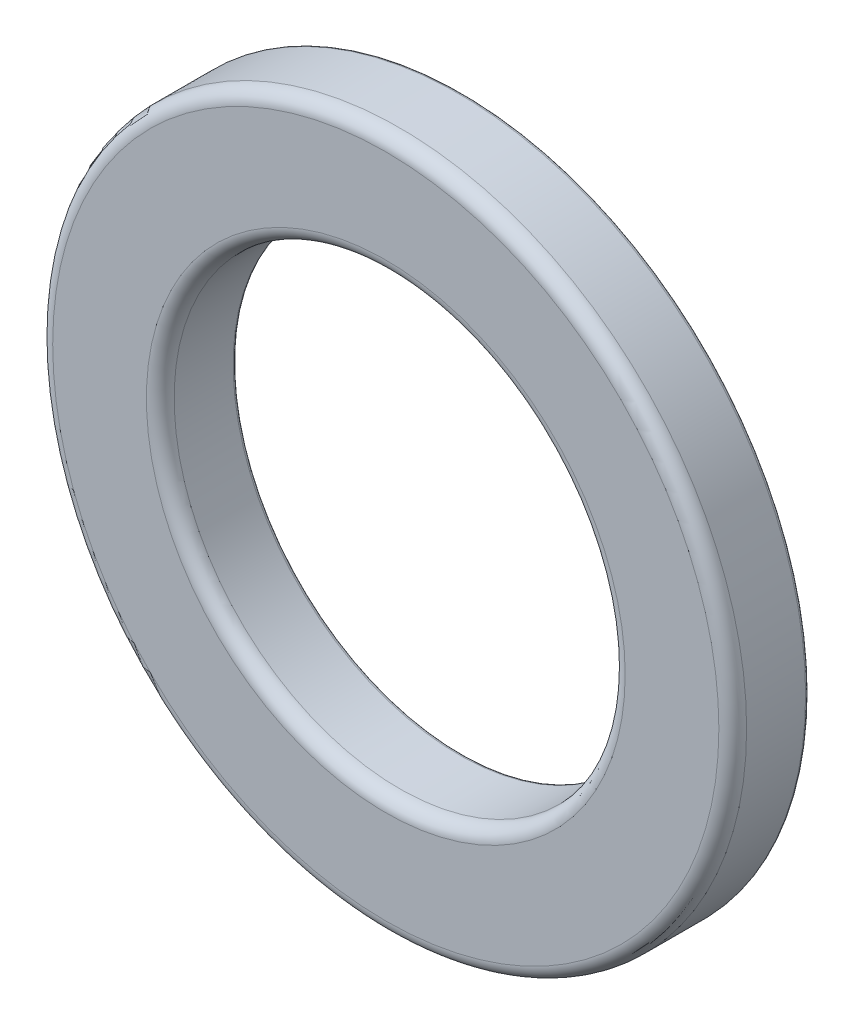
ISO-10303-21;
HEADER;
FILE_DESCRIPTION(('STEP AP214'),'2;1');
FILE_NAME('part.step','',(''),(''),'','','');
FILE_SCHEMA(('AUTOMOTIVE_DESIGN { 1 0 10303 214 1 1 1 1 }'));
ENDSEC;
DATA;
#1=APPLICATION_CONTEXT('core data for automotive mechanical design processes');
#2=APPLICATION_PROTOCOL_DEFINITION('international standard','automotive_design',2000,#1);
#3=PRODUCT_CONTEXT('',#1,'mechanical');
#4=PRODUCT('Part','Part','',(#3));
#5=PRODUCT_RELATED_PRODUCT_CATEGORY('part','',(#4));
#6=PRODUCT_DEFINITION_FORMATION('','',#4);
#7=PRODUCT_DEFINITION_CONTEXT('part definition',#1,'design');
#8=PRODUCT_DEFINITION('design','',#6,#7);
#9=PRODUCT_DEFINITION_SHAPE('','',#8);
#10=(LENGTH_UNIT() NAMED_UNIT(*) SI_UNIT(.MILLI.,.METRE.));
#11=(NAMED_UNIT(*) PLANE_ANGLE_UNIT() SI_UNIT($,.RADIAN.));
#12=(NAMED_UNIT(*) SI_UNIT($,.STERADIAN.) SOLID_ANGLE_UNIT());
#13=UNCERTAINTY_MEASURE_WITH_UNIT(LENGTH_MEASURE(1.E-05),#10,'distance_accuracy_value','');
#14=(GEOMETRIC_REPRESENTATION_CONTEXT(3) GLOBAL_UNCERTAINTY_ASSIGNED_CONTEXT((#13)) GLOBAL_UNIT_ASSIGNED_CONTEXT((#10,
#11,#12)) REPRESENTATION_CONTEXT('',''));
#15=CARTESIAN_POINT('',(0.,0.,0.));
#16=DIRECTION('',(0.,0.,1.));
#17=DIRECTION('',(1.,0.,0.));
#18=AXIS2_PLACEMENT_3D('',#15,#16,#17);
#19=CARTESIAN_POINT('',(0.,0.,-1.1));
#20=DIRECTION('',(0.,0.,1.));
#21=DIRECTION('',(1.,0.,0.));
#22=AXIS2_PLACEMENT_3D('',#19,#20,#21);
#23=CYLINDRICAL_SURFACE('',#22,10.);
#24=CARTESIAN_POINT('',(0.,0.,-1.));
#25=DIRECTION('',(0.,0.,1.));
#26=DIRECTION('',(1.,0.,0.));
#27=AXIS2_PLACEMENT_3D('',#24,#25,#26);
#28=CIRCLE('',#27,10.);
#29=CARTESIAN_POINT('',(10.,0.,-1.));
#30=VERTEX_POINT('',#29);
#31=EDGE_CURVE('E96',#30,#30,#28,.T.);
#32=ORIENTED_EDGE('',*,*,#31,.T.);
#33=EDGE_LOOP('',(#32));
#34=FACE_BOUND('',#33,.T.);
#35=CARTESIAN_POINT('',(0.,0.,0.7));
#36=DIRECTION('',(0.,0.,1.));
#37=DIRECTION('',(1.,0.,0.));
#38=AXIS2_PLACEMENT_3D('',#35,#36,#37);
#39=CIRCLE('',#38,10.);
#40=CARTESIAN_POINT('',(10.,0.,0.7));
#41=VERTEX_POINT('',#40);
#42=EDGE_CURVE('E104',#41,#41,#39,.F.);
#43=ORIENTED_EDGE('',*,*,#42,.T.);
#44=EDGE_LOOP('',(#43));
#45=FACE_BOUND('',#44,.T.);
#46=ADVANCED_FACE('F81',(#34,#45),#23,.T.);
#47=CARTESIAN_POINT('',(0.,0.,-1.1));
#48=DIRECTION('',(0.,0.,1.));
#49=DIRECTION('',(1.,0.,0.));
#50=AXIS2_PLACEMENT_3D('',#47,#48,#49);
#51=PLANE('',#50);
#52=CARTESIAN_POINT('',(0.,0.,-1.1));
#53=DIRECTION('',(0.,0.,1.));
#54=DIRECTION('',(1.,0.,0.));
#55=AXIS2_PLACEMENT_3D('',#52,#53,#54);
#56=CIRCLE('',#55,9.9);
#57=CARTESIAN_POINT('',(9.9,0.,-1.1));
#58=VERTEX_POINT('',#57);
#59=EDGE_CURVE('E88',#58,#58,#56,.F.);
#60=ORIENTED_EDGE('',*,*,#59,.T.);
#61=EDGE_LOOP('',(#60));
#62=FACE_BOUND('',#61,.T.);
#63=CARTESIAN_POINT('',(0.,0.,-1.1));
#64=DIRECTION('',(0.,0.,1.));
#65=DIRECTION('',(1.,0.,0.));
#66=AXIS2_PLACEMENT_3D('',#63,#64,#65);
#67=CIRCLE('',#66,6.6);
#68=CARTESIAN_POINT('',(6.6,0.,-1.1));
#69=VERTEX_POINT('',#68);
#70=EDGE_CURVE('E92',#69,#69,#67,.T.);
#71=ORIENTED_EDGE('',*,*,#70,.T.);
#72=EDGE_LOOP('',(#71));
#73=FACE_BOUND('',#72,.T.);
#74=ADVANCED_FACE('F126',(#62,#73),#51,.F.);
#75=CARTESIAN_POINT('',(0.,0.,-1.1));
#76=DIRECTION('',(0.,0.,1.));
#77=DIRECTION('',(1.,0.,0.));
#78=AXIS2_PLACEMENT_3D('',#75,#76,#77);
#79=CYLINDRICAL_SURFACE('',#78,6.5);
#80=CARTESIAN_POINT('',(0.,0.,-1.));
#81=DIRECTION('',(0.,0.,1.));
#82=DIRECTION('',(1.,0.,0.));
#83=AXIS2_PLACEMENT_3D('',#80,#81,#82);
#84=CIRCLE('',#83,6.5);
#85=CARTESIAN_POINT('',(6.5,0.,-1.));
#86=VERTEX_POINT('',#85);
#87=EDGE_CURVE('E11',#86,#86,#84,.F.);
#88=ORIENTED_EDGE('',*,*,#87,.T.);
#89=EDGE_LOOP('',(#88));
#90=FACE_BOUND('',#89,.T.);
#91=CARTESIAN_POINT('',(0.,0.,0.7));
#92=DIRECTION('',(0.,0.,1.));
#93=DIRECTION('',(1.,0.,0.));
#94=AXIS2_PLACEMENT_3D('',#91,#92,#93);
#95=CIRCLE('',#94,6.5);
#96=CARTESIAN_POINT('',(6.5,0.,0.7));
#97=VERTEX_POINT('',#96);
#98=EDGE_CURVE('E101',#97,#97,#95,.T.);
#99=ORIENTED_EDGE('',*,*,#98,.T.);
#100=EDGE_LOOP('',(#99));
#101=FACE_BOUND('',#100,.T.);
#102=ADVANCED_FACE('F124',(#90,#101),#79,.F.);
#103=CARTESIAN_POINT('',(0.,0.,1.1));
#104=DIRECTION('',(0.,0.,1.));
#105=DIRECTION('',(1.,0.,0.));
#106=AXIS2_PLACEMENT_3D('',#103,#104,#105);
#107=PLANE('',#106);
#108=CARTESIAN_POINT('',(0.,0.,1.1));
#109=DIRECTION('',(0.,0.,1.));
#110=DIRECTION('',(1.,0.,0.));
#111=AXIS2_PLACEMENT_3D('',#108,#109,#110);
#112=CIRCLE('',#111,9.6);
#113=CARTESIAN_POINT('',(9.6,0.,1.1));
#114=VERTEX_POINT('',#113);
#115=EDGE_CURVE('E107',#114,#114,#112,.T.);
#116=ORIENTED_EDGE('',*,*,#115,.T.);
#117=EDGE_LOOP('',(#116));
#118=FACE_BOUND('',#117,.T.);
#119=CARTESIAN_POINT('',(0.,0.,1.1));
#120=DIRECTION('',(0.,0.,1.));
#121=DIRECTION('',(1.,0.,0.));
#122=AXIS2_PLACEMENT_3D('',#119,#120,#121);
#123=CIRCLE('',#122,6.9);
#124=CARTESIAN_POINT('',(6.9,0.,1.1));
#125=VERTEX_POINT('',#124);
#126=EDGE_CURVE('E110',#125,#125,#123,.F.);
#127=ORIENTED_EDGE('',*,*,#126,.T.);
#128=EDGE_LOOP('',(#127));
#129=FACE_BOUND('',#128,.T.);
#130=ADVANCED_FACE('F114',(#118,#129),#107,.T.);
#131=CARTESIAN_POINT('',(0.,0.,0.7));
#132=DIRECTION('',(0.,0.,1.));
#133=DIRECTION('',(1.,0.,0.));
#134=AXIS2_PLACEMENT_3D('',#131,#132,#133);
#135=TOROIDAL_SURFACE('',#134,9.6,0.4);
#136=ORIENTED_EDGE('',*,*,#42,.F.);
#137=EDGE_LOOP('',(#136));
#138=FACE_BOUND('',#137,.T.);
#139=ORIENTED_EDGE('',*,*,#115,.F.);
#140=EDGE_LOOP('',(#139));
#141=FACE_BOUND('',#140,.T.);
#142=ADVANCED_FACE('F120',(#138,#141),#135,.T.);
#143=CARTESIAN_POINT('',(0.,0.,0.7));
#144=DIRECTION('',(0.,0.,1.));
#145=DIRECTION('',(1.,0.,0.));
#146=AXIS2_PLACEMENT_3D('',#143,#144,#145);
#147=TOROIDAL_SURFACE('',#146,6.9,0.4);
#148=ORIENTED_EDGE('',*,*,#126,.F.);
#149=EDGE_LOOP('',(#148));
#150=FACE_BOUND('',#149,.T.);
#151=ORIENTED_EDGE('',*,*,#98,.F.);
#152=EDGE_LOOP('',(#151));
#153=FACE_BOUND('',#152,.T.);
#154=ADVANCED_FACE('F116',(#150,#153),#147,.T.);
#155=CARTESIAN_POINT('',(0.,0.,-1.));
#156=DIRECTION('',(0.,0.,1.));
#157=DIRECTION('',(1.,0.,0.));
#158=AXIS2_PLACEMENT_3D('',#155,#156,#157);
#159=TOROIDAL_SURFACE('',#158,9.9,0.1);
#160=ORIENTED_EDGE('',*,*,#59,.F.);
#161=EDGE_LOOP('',(#160));
#162=FACE_BOUND('',#161,.T.);
#163=ORIENTED_EDGE('',*,*,#31,.F.);
#164=EDGE_LOOP('',(#163));
#165=FACE_BOUND('',#164,.T.);
#166=ADVANCED_FACE('F119',(#162,#165),#159,.T.);
#167=CARTESIAN_POINT('',(0.,0.,-1.));
#168=DIRECTION('',(0.,0.,1.));
#169=DIRECTION('',(1.,0.,0.));
#170=AXIS2_PLACEMENT_3D('',#167,#168,#169);
#171=TOROIDAL_SURFACE('',#170,6.6,0.1);
#172=ORIENTED_EDGE('',*,*,#87,.F.);
#173=EDGE_LOOP('',(#172));
#174=FACE_BOUND('',#173,.T.);
#175=ORIENTED_EDGE('',*,*,#70,.F.);
#176=EDGE_LOOP('',(#175));
#177=FACE_BOUND('',#176,.T.);
#178=ADVANCED_FACE('F83',(#174,#177),#171,.T.);
#179=CLOSED_SHELL('',(#46,#74,#102,#130,#142,#154,#166,#178));
#180=MANIFOLD_SOLID_BREP('B2',#179);
#181=ADVANCED_BREP_SHAPE_REPRESENTATION('',(#18,#180),#14);
#182=SHAPE_DEFINITION_REPRESENTATION(#9,#181);
ENDSEC;
END-ISO-10303-21;
